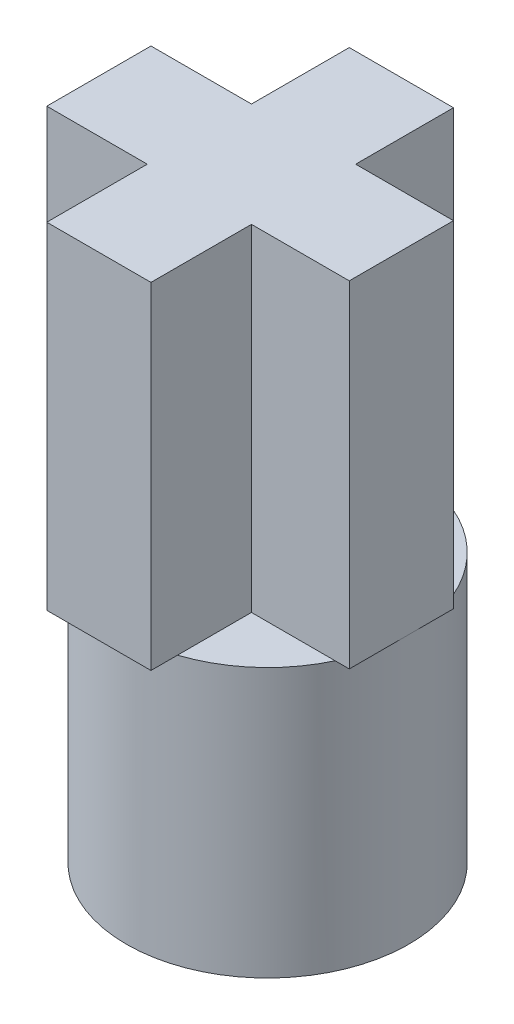
ISO-10303-21;
HEADER;
FILE_DESCRIPTION(('STEP AP214'),'2;1');
FILE_NAME('part.step','',(''),(''),'','','');
FILE_SCHEMA(('AUTOMOTIVE_DESIGN { 1 0 10303 214 1 1 1 1 }'));
ENDSEC;
DATA;
#1=APPLICATION_CONTEXT('core data for automotive mechanical design processes');
#2=APPLICATION_PROTOCOL_DEFINITION('international standard','automotive_design',2000,#1);
#3=PRODUCT_CONTEXT('',#1,'mechanical');
#4=PRODUCT('Part','Part','',(#3));
#5=PRODUCT_RELATED_PRODUCT_CATEGORY('part','',(#4));
#6=PRODUCT_DEFINITION_FORMATION('','',#4);
#7=PRODUCT_DEFINITION_CONTEXT('part definition',#1,'design');
#8=PRODUCT_DEFINITION('design','',#6,#7);
#9=PRODUCT_DEFINITION_SHAPE('','',#8);
#10=(LENGTH_UNIT() NAMED_UNIT(*) SI_UNIT(.MILLI.,.METRE.));
#11=(NAMED_UNIT(*) PLANE_ANGLE_UNIT() SI_UNIT($,.RADIAN.));
#12=(NAMED_UNIT(*) SI_UNIT($,.STERADIAN.) SOLID_ANGLE_UNIT());
#13=UNCERTAINTY_MEASURE_WITH_UNIT(LENGTH_MEASURE(1.E-05),#10,'distance_accuracy_value','');
#14=(GEOMETRIC_REPRESENTATION_CONTEXT(3) GLOBAL_UNCERTAINTY_ASSIGNED_CONTEXT((#13)) GLOBAL_UNIT_ASSIGNED_CONTEXT((#10,
#11,#12)) REPRESENTATION_CONTEXT('',''));
#15=CARTESIAN_POINT('',(0.,0.,0.));
#16=DIRECTION('',(0.,0.,1.));
#17=DIRECTION('',(1.,0.,0.));
#18=AXIS2_PLACEMENT_3D('',#15,#16,#17);
#19=CARTESIAN_POINT('',(0.,4.,0.));
#20=DIRECTION('',(0.,1.,0.));
#21=DIRECTION('',(0.,0.,1.));
#22=AXIS2_PLACEMENT_3D('',#19,#20,#21);
#23=PLANE('',#22);
#24=DIRECTION('',(0.,0.,-1.));
#25=VECTOR('',#24,1.);
#26=CARTESIAN_POINT('',(0.655,4.,-0.655));
#27=LINE('',#26,#25);
#28=CARTESIAN_POINT('',(0.655,4.,-0.655));
#29=VERTEX_POINT('',#28);
#30=CARTESIAN_POINT('',(0.655,4.,-1.99523808103194));
#31=VERTEX_POINT('',#30);
#32=EDGE_CURVE('E53',#29,#31,#27,.T.);
#33=ORIENTED_EDGE('',*,*,#32,.F.);
#34=DIRECTION('',(-1.,0.,0.));
#35=VECTOR('',#34,1.);
#36=CARTESIAN_POINT('',(2.11,4.,-0.655));
#37=LINE('',#36,#35);
#38=CARTESIAN_POINT('',(1.99523808103194,4.,-0.655));
#39=VERTEX_POINT('',#38);
#40=EDGE_CURVE('E11',#39,#29,#37,.T.);
#41=ORIENTED_EDGE('',*,*,#40,.F.);
#42=CARTESIAN_POINT('',(0.,4.,0.));
#43=DIRECTION('',(0.,1.,0.));
#44=DIRECTION('',(0.,0.,1.));
#45=AXIS2_PLACEMENT_3D('',#42,#43,#44);
#46=CIRCLE('',#45,2.1);
#47=EDGE_CURVE('E197',#39,#31,#46,.T.);
#48=ORIENTED_EDGE('',*,*,#47,.T.);
#49=EDGE_LOOP('',(#33,#41,#48));
#50=FACE_BOUND('',#49,.T.);
#51=ADVANCED_FACE('F35',(#50),#23,.T.);
#52=DIRECTION('',(1.,0.,0.));
#53=VECTOR('',#52,1.);
#54=CARTESIAN_POINT('',(2.11,4.,0.895));
#55=LINE('',#54,#53);
#56=CARTESIAN_POINT('',(0.655,4.,0.895));
#57=VERTEX_POINT('',#56);
#58=CARTESIAN_POINT('',(1.89973024400834,4.,0.895));
#59=VERTEX_POINT('',#58);
#60=EDGE_CURVE('E60',#57,#59,#55,.T.);
#61=ORIENTED_EDGE('',*,*,#60,.F.);
#62=DIRECTION('',(0.,0.,-1.));
#63=VECTOR('',#62,1.);
#64=CARTESIAN_POINT('',(0.655,4.,2.39));
#65=LINE('',#64,#63);
#66=CARTESIAN_POINT('',(0.655,4.,1.99523808103194));
#67=VERTEX_POINT('',#66);
#68=EDGE_CURVE('E44',#67,#57,#65,.T.);
#69=ORIENTED_EDGE('',*,*,#68,.F.);
#70=EDGE_CURVE('E188',#67,#59,#46,.T.);
#71=ORIENTED_EDGE('',*,*,#70,.T.);
#72=EDGE_LOOP('',(#61,#69,#71));
#73=FACE_BOUND('',#72,.T.);
#74=ADVANCED_FACE('F227',(#73),#23,.T.);
#75=DIRECTION('',(0.,0.,1.));
#76=VECTOR('',#75,1.);
#77=CARTESIAN_POINT('',(-0.895,4.,2.39));
#78=LINE('',#77,#76);
#79=CARTESIAN_POINT('',(-0.895,4.,0.895));
#80=VERTEX_POINT('',#79);
#81=CARTESIAN_POINT('',(-0.895,4.,1.89973024400834));
#82=VERTEX_POINT('',#81);
#83=EDGE_CURVE('E442',#80,#82,#78,.T.);
#84=ORIENTED_EDGE('',*,*,#83,.F.);
#85=DIRECTION('',(1.,0.,0.));
#86=VECTOR('',#85,1.);
#87=CARTESIAN_POINT('',(-0.895,4.,0.895));
#88=LINE('',#87,#86);
#89=CARTESIAN_POINT('',(-1.89973024400834,4.,0.895));
#90=VERTEX_POINT('',#89);
#91=EDGE_CURVE('E193',#90,#80,#88,.T.);
#92=ORIENTED_EDGE('',*,*,#91,.F.);
#93=EDGE_CURVE('E199',#90,#82,#46,.T.);
#94=ORIENTED_EDGE('',*,*,#93,.T.);
#95=EDGE_LOOP('',(#84,#92,#94));
#96=FACE_BOUND('',#95,.T.);
#97=ADVANCED_FACE('F224',(#96),#23,.T.);
#98=CARTESIAN_POINT('',(0.,4.,0.));
#99=DIRECTION('',(0.,-1.,0.));
#100=DIRECTION('',(0.,0.,-1.));
#101=AXIS2_PLACEMENT_3D('',#98,#99,#100);
#102=CYLINDRICAL_SURFACE('',#101,2.1);
#103=ORIENTED_EDGE('',*,*,#70,.F.);
#104=EDGE_CURVE('E190',#82,#67,#46,.T.);
#105=ORIENTED_EDGE('',*,*,#104,.F.);
#106=ORIENTED_EDGE('',*,*,#93,.F.);
#107=CARTESIAN_POINT('',(-1.99523808103194,4.,-0.655));
#108=VERTEX_POINT('',#107);
#109=EDGE_CURVE('E205',#108,#90,#46,.T.);
#110=ORIENTED_EDGE('',*,*,#109,.F.);
#111=CARTESIAN_POINT('',(-0.895,4.,-1.89973024400834));
#112=VERTEX_POINT('',#111);
#113=EDGE_CURVE('E523',#112,#108,#46,.T.);
#114=ORIENTED_EDGE('',*,*,#113,.F.);
#115=EDGE_CURVE('E524',#31,#112,#46,.T.);
#116=ORIENTED_EDGE('',*,*,#115,.F.);
#117=ORIENTED_EDGE('',*,*,#47,.F.);
#118=EDGE_CURVE('E189',#59,#39,#46,.T.);
#119=ORIENTED_EDGE('',*,*,#118,.F.);
#120=EDGE_LOOP('',(#103,#105,#106,#110,#114,#116,#117,#119));
#121=FACE_BOUND('',#120,.T.);
#122=CARTESIAN_POINT('',(0.,0.,0.));
#123=DIRECTION('',(0.,1.,0.));
#124=DIRECTION('',(0.,0.,1.));
#125=AXIS2_PLACEMENT_3D('',#122,#123,#124);
#126=CIRCLE('',#125,2.1);
#127=CARTESIAN_POINT('',(0.,0.,2.1));
#128=VERTEX_POINT('',#127);
#129=EDGE_CURVE('E39',#128,#128,#126,.T.);
#130=ORIENTED_EDGE('',*,*,#129,.T.);
#131=EDGE_LOOP('',(#130));
#132=FACE_BOUND('',#131,.T.);
#133=ADVANCED_FACE('F37',(#121,#132),#102,.T.);
#134=DIRECTION('',(0.,0.,1.));
#135=VECTOR('',#134,1.);
#136=CARTESIAN_POINT('',(-0.895,4.,-0.655));
#137=LINE('',#136,#135);
#138=CARTESIAN_POINT('',(-0.895,4.,-0.655));
#139=VERTEX_POINT('',#138);
#140=EDGE_CURVE('E177',#112,#139,#137,.T.);
#141=ORIENTED_EDGE('',*,*,#140,.F.);
#142=ORIENTED_EDGE('',*,*,#113,.T.);
#143=DIRECTION('',(-1.,0.,0.));
#144=VECTOR('',#143,1.);
#145=CARTESIAN_POINT('',(-0.895,4.,-0.655));
#146=LINE('',#145,#144);
#147=EDGE_CURVE('E498',#139,#108,#146,.T.);
#148=ORIENTED_EDGE('',*,*,#147,.F.);
#149=EDGE_LOOP('',(#141,#142,#148));
#150=FACE_BOUND('',#149,.T.);
#151=ADVANCED_FACE('F213',(#150),#23,.T.);
#152=CARTESIAN_POINT('',(0.,0.,0.));
#153=DIRECTION('',(0.,1.,0.));
#154=DIRECTION('',(0.,0.,1.));
#155=AXIS2_PLACEMENT_3D('',#152,#153,#154);
#156=PLANE('',#155);
#157=CARTESIAN_POINT('',(0.,0.,0.));
#158=DIRECTION('',(0.,-1.,0.));
#159=DIRECTION('',(0.,0.,-1.));
#160=AXIS2_PLACEMENT_3D('',#157,#158,#159);
#161=CIRCLE('',#160,1.6);
#162=CARTESIAN_POINT('',(0.,0.,-1.6));
#163=VERTEX_POINT('',#162);
#164=EDGE_CURVE('E178',#163,#163,#161,.T.);
#165=ORIENTED_EDGE('',*,*,#164,.F.);
#166=EDGE_LOOP('',(#165));
#167=FACE_BOUND('',#166,.T.);
#168=ORIENTED_EDGE('',*,*,#129,.F.);
#169=EDGE_LOOP('',(#168));
#170=FACE_BOUND('',#169,.T.);
#171=ADVANCED_FACE('F210',(#167,#170),#156,.F.);
#172=CARTESIAN_POINT('',(0.,3.,0.));
#173=DIRECTION('',(0.,-1.,0.));
#174=DIRECTION('',(0.,0.,-1.));
#175=AXIS2_PLACEMENT_3D('',#172,#173,#174);
#176=CYLINDRICAL_SURFACE('',#175,1.6);
#177=CARTESIAN_POINT('',(0.,3.,0.));
#178=DIRECTION('',(0.,-1.,0.));
#179=DIRECTION('',(0.,0.,-1.));
#180=AXIS2_PLACEMENT_3D('',#177,#178,#179);
#181=CIRCLE('',#180,1.6);
#182=CARTESIAN_POINT('',(0.,3.,-1.6));
#183=VERTEX_POINT('',#182);
#184=EDGE_CURVE('E181',#183,#183,#181,.T.);
#185=ORIENTED_EDGE('',*,*,#184,.F.);
#186=EDGE_LOOP('',(#185));
#187=FACE_BOUND('',#186,.T.);
#188=ORIENTED_EDGE('',*,*,#164,.T.);
#189=EDGE_LOOP('',(#188));
#190=FACE_BOUND('',#189,.T.);
#191=ADVANCED_FACE('F212',(#187,#190),#176,.F.);
#192=CARTESIAN_POINT('',(0.,3.,0.));
#193=DIRECTION('',(0.,-1.,0.));
#194=DIRECTION('',(0.,0.,-1.));
#195=AXIS2_PLACEMENT_3D('',#192,#193,#194);
#196=PLANE('',#195);
#197=ORIENTED_EDGE('',*,*,#184,.T.);
#198=EDGE_LOOP('',(#197));
#199=FACE_BOUND('',#198,.T.);
#200=ADVANCED_FACE('F219',(#199),#196,.T.);
#201=CARTESIAN_POINT('',(0.,4.,0.));
#202=DIRECTION('',(0.,1.,0.));
#203=DIRECTION('',(0.,0.,1.));
#204=AXIS2_PLACEMENT_3D('',#201,#202,#203);
#205=PLANE('',#204);
#206=CARTESIAN_POINT('',(2.11,4.,0.895));
#207=VERTEX_POINT('',#206);
#208=EDGE_CURVE('E492',#59,#207,#55,.T.);
#209=ORIENTED_EDGE('',*,*,#208,.F.);
#210=ORIENTED_EDGE('',*,*,#118,.T.);
#211=CARTESIAN_POINT('',(2.11,4.,-0.655));
#212=VERTEX_POINT('',#211);
#213=EDGE_CURVE('E46',#212,#39,#37,.T.);
#214=ORIENTED_EDGE('',*,*,#213,.F.);
#215=DIRECTION('',(0.,0.,-1.));
#216=VECTOR('',#215,1.);
#217=CARTESIAN_POINT('',(2.11,4.,0.895));
#218=LINE('',#217,#216);
#219=EDGE_CURVE('E489',#207,#212,#218,.T.);
#220=ORIENTED_EDGE('',*,*,#219,.F.);
#221=EDGE_LOOP('',(#209,#210,#214,#220));
#222=FACE_BOUND('',#221,.T.);
#223=ADVANCED_FACE('F234',(#222),#205,.F.);
#224=CARTESIAN_POINT('',(0.655,4.,-2.11));
#225=VERTEX_POINT('',#224);
#226=EDGE_CURVE('E486',#31,#225,#27,.T.);
#227=ORIENTED_EDGE('',*,*,#226,.F.);
#228=ORIENTED_EDGE('',*,*,#115,.T.);
#229=CARTESIAN_POINT('',(-0.895,4.,-2.11));
#230=VERTEX_POINT('',#229);
#231=EDGE_CURVE('E195',#230,#112,#137,.T.);
#232=ORIENTED_EDGE('',*,*,#231,.F.);
#233=DIRECTION('',(-1.,0.,0.));
#234=VECTOR('',#233,1.);
#235=CARTESIAN_POINT('',(0.655,4.,-2.11));
#236=LINE('',#235,#234);
#237=EDGE_CURVE('E172',#225,#230,#236,.T.);
#238=ORIENTED_EDGE('',*,*,#237,.F.);
#239=EDGE_LOOP('',(#227,#228,#232,#238));
#240=FACE_BOUND('',#239,.T.);
#241=ADVANCED_FACE('F283',(#240),#205,.F.);
#242=CARTESIAN_POINT('',(-2.39,4.,-0.655));
#243=VERTEX_POINT('',#242);
#244=EDGE_CURVE('E499',#108,#243,#146,.T.);
#245=ORIENTED_EDGE('',*,*,#244,.F.);
#246=ORIENTED_EDGE('',*,*,#109,.T.);
#247=CARTESIAN_POINT('',(-2.39,4.,0.895));
#248=VERTEX_POINT('',#247);
#249=EDGE_CURVE('E456',#248,#90,#88,.T.);
#250=ORIENTED_EDGE('',*,*,#249,.F.);
#251=DIRECTION('',(0.,0.,1.));
#252=VECTOR('',#251,1.);
#253=CARTESIAN_POINT('',(-2.39,4.,0.895));
#254=LINE('',#253,#252);
#255=EDGE_CURVE('E496',#243,#248,#254,.T.);
#256=ORIENTED_EDGE('',*,*,#255,.F.);
#257=EDGE_LOOP('',(#245,#246,#250,#256));
#258=FACE_BOUND('',#257,.T.);
#259=ADVANCED_FACE('F342',(#258),#205,.F.);
#260=CARTESIAN_POINT('',(-0.895,4.,2.39));
#261=VERTEX_POINT('',#260);
#262=EDGE_CURVE('E447',#82,#261,#78,.T.);
#263=ORIENTED_EDGE('',*,*,#262,.F.);
#264=ORIENTED_EDGE('',*,*,#104,.T.);
#265=CARTESIAN_POINT('',(0.655,4.,2.39));
#266=VERTEX_POINT('',#265);
#267=EDGE_CURVE('E493',#266,#67,#65,.T.);
#268=ORIENTED_EDGE('',*,*,#267,.F.);
#269=DIRECTION('',(1.,0.,0.));
#270=VECTOR('',#269,1.);
#271=CARTESIAN_POINT('',(0.655,4.,2.39));
#272=LINE('',#271,#270);
#273=EDGE_CURVE('E446',#261,#266,#272,.T.);
#274=ORIENTED_EDGE('',*,*,#273,.F.);
#275=EDGE_LOOP('',(#263,#264,#268,#274));
#276=FACE_BOUND('',#275,.T.);
#277=ADVANCED_FACE('F238',(#276),#205,.F.);
#278=CARTESIAN_POINT('',(-0.895,9.,-0.655));
#279=DIRECTION('',(1.,0.,0.));
#280=DIRECTION('',(0.,0.,-1.));
#281=AXIS2_PLACEMENT_3D('',#278,#279,#280);
#282=PLANE('',#281);
#283=ORIENTED_EDGE('',*,*,#231,.T.);
#284=ORIENTED_EDGE('',*,*,#140,.T.);
#285=DIRECTION('',(0.,-1.,0.));
#286=VECTOR('',#285,1.);
#287=CARTESIAN_POINT('',(-0.895,9.,-0.655));
#288=LINE('',#287,#286);
#289=CARTESIAN_POINT('',(-0.895,9.,-0.655));
#290=VERTEX_POINT('',#289);
#291=EDGE_CURVE('E157',#290,#139,#288,.T.);
#292=ORIENTED_EDGE('',*,*,#291,.F.);
#293=DIRECTION('',(0.,0.,1.));
#294=VECTOR('',#293,1.);
#295=CARTESIAN_POINT('',(-0.895,9.,-0.655));
#296=LINE('',#295,#294);
#297=CARTESIAN_POINT('',(-0.895,9.,-2.11));
#298=VERTEX_POINT('',#297);
#299=EDGE_CURVE('E163',#298,#290,#296,.T.);
#300=ORIENTED_EDGE('',*,*,#299,.F.);
#301=DIRECTION('',(0.,-1.,0.));
#302=VECTOR('',#301,1.);
#303=CARTESIAN_POINT('',(-0.895,9.,-2.11));
#304=LINE('',#303,#302);
#305=EDGE_CURVE('E483',#298,#230,#304,.T.);
#306=ORIENTED_EDGE('',*,*,#305,.T.);
#307=EDGE_LOOP('',(#283,#284,#292,#300,#306));
#308=FACE_BOUND('',#307,.T.);
#309=ADVANCED_FACE('F176',(#308),#282,.F.);
#310=CARTESIAN_POINT('',(-0.895,9.,-0.655));
#311=DIRECTION('',(0.,0.,1.));
#312=DIRECTION('',(1.,0.,0.));
#313=AXIS2_PLACEMENT_3D('',#310,#311,#312);
#314=PLANE('',#313);
#315=ORIENTED_EDGE('',*,*,#147,.T.);
#316=ORIENTED_EDGE('',*,*,#244,.T.);
#317=DIRECTION('',(0.,-1.,0.));
#318=VECTOR('',#317,1.);
#319=CARTESIAN_POINT('',(-2.39,9.,-0.655));
#320=LINE('',#319,#318);
#321=CARTESIAN_POINT('',(-2.39,9.,-0.655));
#322=VERTEX_POINT('',#321);
#323=EDGE_CURVE('E159',#322,#243,#320,.T.);
#324=ORIENTED_EDGE('',*,*,#323,.F.);
#325=DIRECTION('',(-1.,0.,0.));
#326=VECTOR('',#325,1.);
#327=CARTESIAN_POINT('',(-0.895,9.,-0.655));
#328=LINE('',#327,#326);
#329=EDGE_CURVE('E152',#290,#322,#328,.T.);
#330=ORIENTED_EDGE('',*,*,#329,.F.);
#331=ORIENTED_EDGE('',*,*,#291,.T.);
#332=EDGE_LOOP('',(#315,#316,#324,#330,#331));
#333=FACE_BOUND('',#332,.T.);
#334=ADVANCED_FACE('F155',(#333),#314,.F.);
#335=CARTESIAN_POINT('',(-2.39,9.,0.895));
#336=DIRECTION('',(1.,0.,0.));
#337=DIRECTION('',(0.,0.,-1.));
#338=AXIS2_PLACEMENT_3D('',#335,#336,#337);
#339=PLANE('',#338);
#340=ORIENTED_EDGE('',*,*,#255,.T.);
#341=DIRECTION('',(0.,-1.,0.));
#342=VECTOR('',#341,1.);
#343=CARTESIAN_POINT('',(-2.39,9.,0.895));
#344=LINE('',#343,#342);
#345=CARTESIAN_POINT('',(-2.39,9.,0.895));
#346=VERTEX_POINT('',#345);
#347=EDGE_CURVE('E183',#346,#248,#344,.T.);
#348=ORIENTED_EDGE('',*,*,#347,.F.);
#349=DIRECTION('',(0.,0.,1.));
#350=VECTOR('',#349,1.);
#351=CARTESIAN_POINT('',(-2.39,9.,0.895));
#352=LINE('',#351,#350);
#353=EDGE_CURVE('E162',#322,#346,#352,.T.);
#354=ORIENTED_EDGE('',*,*,#353,.F.);
#355=ORIENTED_EDGE('',*,*,#323,.T.);
#356=EDGE_LOOP('',(#340,#348,#354,#355));
#357=FACE_BOUND('',#356,.T.);
#358=ADVANCED_FACE('F241',(#357),#339,.F.);
#359=CARTESIAN_POINT('',(-0.895,9.,0.895));
#360=DIRECTION('',(0.,0.,-1.));
#361=DIRECTION('',(-1.,0.,0.));
#362=AXIS2_PLACEMENT_3D('',#359,#360,#361);
#363=PLANE('',#362);
#364=ORIENTED_EDGE('',*,*,#249,.T.);
#365=ORIENTED_EDGE('',*,*,#91,.T.);
#366=DIRECTION('',(0.,-1.,0.));
#367=VECTOR('',#366,1.);
#368=CARTESIAN_POINT('',(-0.895,9.,0.895));
#369=LINE('',#368,#367);
#370=CARTESIAN_POINT('',(-0.895,9.,0.895));
#371=VERTEX_POINT('',#370);
#372=EDGE_CURVE('E452',#371,#80,#369,.T.);
#373=ORIENTED_EDGE('',*,*,#372,.F.);
#374=DIRECTION('',(1.,0.,0.));
#375=VECTOR('',#374,1.);
#376=CARTESIAN_POINT('',(-0.895,9.,0.895));
#377=LINE('',#376,#375);
#378=EDGE_CURVE('E515',#346,#371,#377,.T.);
#379=ORIENTED_EDGE('',*,*,#378,.F.);
#380=ORIENTED_EDGE('',*,*,#347,.T.);
#381=EDGE_LOOP('',(#364,#365,#373,#379,#380));
#382=FACE_BOUND('',#381,.T.);
#383=ADVANCED_FACE('F244',(#382),#363,.F.);
#384=CARTESIAN_POINT('',(-0.895,9.,2.39));
#385=DIRECTION('',(1.,0.,0.));
#386=DIRECTION('',(0.,0.,-1.));
#387=AXIS2_PLACEMENT_3D('',#384,#385,#386);
#388=PLANE('',#387);
#389=ORIENTED_EDGE('',*,*,#83,.T.);
#390=ORIENTED_EDGE('',*,*,#262,.T.);
#391=DIRECTION('',(0.,-1.,0.));
#392=VECTOR('',#391,1.);
#393=CARTESIAN_POINT('',(-0.895,9.,2.39));
#394=LINE('',#393,#392);
#395=CARTESIAN_POINT('',(-0.895,9.,2.39));
#396=VERTEX_POINT('',#395);
#397=EDGE_CURVE('E460',#396,#261,#394,.T.);
#398=ORIENTED_EDGE('',*,*,#397,.F.);
#399=DIRECTION('',(0.,0.,1.));
#400=VECTOR('',#399,1.);
#401=CARTESIAN_POINT('',(-0.895,9.,2.39));
#402=LINE('',#401,#400);
#403=EDGE_CURVE('E459',#371,#396,#402,.T.);
#404=ORIENTED_EDGE('',*,*,#403,.F.);
#405=ORIENTED_EDGE('',*,*,#372,.T.);
#406=EDGE_LOOP('',(#389,#390,#398,#404,#405));
#407=FACE_BOUND('',#406,.T.);
#408=ADVANCED_FACE('F248',(#407),#388,.F.);
#409=CARTESIAN_POINT('',(0.655,9.,2.39));
#410=DIRECTION('',(0.,0.,-1.));
#411=DIRECTION('',(-1.,0.,0.));
#412=AXIS2_PLACEMENT_3D('',#409,#410,#411);
#413=PLANE('',#412);
#414=ORIENTED_EDGE('',*,*,#273,.T.);
#415=DIRECTION('',(0.,-1.,0.));
#416=VECTOR('',#415,1.);
#417=CARTESIAN_POINT('',(0.655,9.,2.39));
#418=LINE('',#417,#416);
#419=CARTESIAN_POINT('',(0.655,9.,2.39));
#420=VERTEX_POINT('',#419);
#421=EDGE_CURVE('E463',#420,#266,#418,.T.);
#422=ORIENTED_EDGE('',*,*,#421,.F.);
#423=DIRECTION('',(1.,0.,0.));
#424=VECTOR('',#423,1.);
#425=CARTESIAN_POINT('',(0.655,9.,2.39));
#426=LINE('',#425,#424);
#427=EDGE_CURVE('E512',#396,#420,#426,.T.);
#428=ORIENTED_EDGE('',*,*,#427,.F.);
#429=ORIENTED_EDGE('',*,*,#397,.T.);
#430=EDGE_LOOP('',(#414,#422,#428,#429));
#431=FACE_BOUND('',#430,.T.);
#432=ADVANCED_FACE('F252',(#431),#413,.F.);
#433=CARTESIAN_POINT('',(0.655,9.,2.39));
#434=DIRECTION('',(-1.,0.,0.));
#435=DIRECTION('',(0.,0.,1.));
#436=AXIS2_PLACEMENT_3D('',#433,#434,#435);
#437=PLANE('',#436);
#438=ORIENTED_EDGE('',*,*,#267,.T.);
#439=ORIENTED_EDGE('',*,*,#68,.T.);
#440=DIRECTION('',(0.,-1.,0.));
#441=VECTOR('',#440,1.);
#442=CARTESIAN_POINT('',(0.655,9.,0.895));
#443=LINE('',#442,#441);
#444=CARTESIAN_POINT('',(0.655,9.,0.895));
#445=VERTEX_POINT('',#444);
#446=EDGE_CURVE('E468',#445,#57,#443,.T.);
#447=ORIENTED_EDGE('',*,*,#446,.F.);
#448=DIRECTION('',(0.,0.,-1.));
#449=VECTOR('',#448,1.);
#450=CARTESIAN_POINT('',(0.655,9.,2.39));
#451=LINE('',#450,#449);
#452=EDGE_CURVE('E510',#420,#445,#451,.T.);
#453=ORIENTED_EDGE('',*,*,#452,.F.);
#454=ORIENTED_EDGE('',*,*,#421,.T.);
#455=EDGE_LOOP('',(#438,#439,#447,#453,#454));
#456=FACE_BOUND('',#455,.T.);
#457=ADVANCED_FACE('F256',(#456),#437,.F.);
#458=CARTESIAN_POINT('',(2.11,9.,0.895));
#459=DIRECTION('',(0.,0.,-1.));
#460=DIRECTION('',(-1.,0.,0.));
#461=AXIS2_PLACEMENT_3D('',#458,#459,#460);
#462=PLANE('',#461);
#463=ORIENTED_EDGE('',*,*,#60,.T.);
#464=ORIENTED_EDGE('',*,*,#208,.T.);
#465=DIRECTION('',(0.,-1.,0.));
#466=VECTOR('',#465,1.);
#467=CARTESIAN_POINT('',(2.11,9.,0.895));
#468=LINE('',#467,#466);
#469=CARTESIAN_POINT('',(2.11,9.,0.895));
#470=VERTEX_POINT('',#469);
#471=EDGE_CURVE('E471',#470,#207,#468,.T.);
#472=ORIENTED_EDGE('',*,*,#471,.F.);
#473=DIRECTION('',(1.,0.,0.));
#474=VECTOR('',#473,1.);
#475=CARTESIAN_POINT('',(2.11,9.,0.895));
#476=LINE('',#475,#474);
#477=EDGE_CURVE('E508',#445,#470,#476,.T.);
#478=ORIENTED_EDGE('',*,*,#477,.F.);
#479=ORIENTED_EDGE('',*,*,#446,.T.);
#480=EDGE_LOOP('',(#463,#464,#472,#478,#479));
#481=FACE_BOUND('',#480,.T.);
#482=ADVANCED_FACE('F260',(#481),#462,.F.);
#483=CARTESIAN_POINT('',(2.11,9.,0.895));
#484=DIRECTION('',(-1.,0.,0.));
#485=DIRECTION('',(0.,0.,1.));
#486=AXIS2_PLACEMENT_3D('',#483,#484,#485);
#487=PLANE('',#486);
#488=ORIENTED_EDGE('',*,*,#219,.T.);
#489=DIRECTION('',(0.,-1.,0.));
#490=VECTOR('',#489,1.);
#491=CARTESIAN_POINT('',(2.11,9.,-0.655));
#492=LINE('',#491,#490);
#493=CARTESIAN_POINT('',(2.11,9.,-0.655));
#494=VERTEX_POINT('',#493);
#495=EDGE_CURVE('E474',#494,#212,#492,.T.);
#496=ORIENTED_EDGE('',*,*,#495,.F.);
#497=DIRECTION('',(0.,0.,-1.));
#498=VECTOR('',#497,1.);
#499=CARTESIAN_POINT('',(2.11,9.,0.895));
#500=LINE('',#499,#498);
#501=EDGE_CURVE('E506',#470,#494,#500,.T.);
#502=ORIENTED_EDGE('',*,*,#501,.F.);
#503=ORIENTED_EDGE('',*,*,#471,.T.);
#504=EDGE_LOOP('',(#488,#496,#502,#503));
#505=FACE_BOUND('',#504,.T.);
#506=ADVANCED_FACE('F264',(#505),#487,.F.);
#507=CARTESIAN_POINT('',(2.11,9.,-0.655));
#508=DIRECTION('',(0.,0.,1.));
#509=DIRECTION('',(1.,0.,0.));
#510=AXIS2_PLACEMENT_3D('',#507,#508,#509);
#511=PLANE('',#510);
#512=ORIENTED_EDGE('',*,*,#213,.T.);
#513=ORIENTED_EDGE('',*,*,#40,.T.);
#514=DIRECTION('',(0.,-1.,0.));
#515=VECTOR('',#514,1.);
#516=CARTESIAN_POINT('',(0.655,9.,-0.655));
#517=LINE('',#516,#515);
#518=CARTESIAN_POINT('',(0.655,9.,-0.655));
#519=VERTEX_POINT('',#518);
#520=EDGE_CURVE('E477',#519,#29,#517,.T.);
#521=ORIENTED_EDGE('',*,*,#520,.F.);
#522=DIRECTION('',(-1.,0.,0.));
#523=VECTOR('',#522,1.);
#524=CARTESIAN_POINT('',(2.11,9.,-0.655));
#525=LINE('',#524,#523);
#526=EDGE_CURVE('E504',#494,#519,#525,.T.);
#527=ORIENTED_EDGE('',*,*,#526,.F.);
#528=ORIENTED_EDGE('',*,*,#495,.T.);
#529=EDGE_LOOP('',(#512,#513,#521,#527,#528));
#530=FACE_BOUND('',#529,.T.);
#531=ADVANCED_FACE('F268',(#530),#511,.F.);
#532=CARTESIAN_POINT('',(0.655,9.,-0.655));
#533=DIRECTION('',(-1.,0.,0.));
#534=DIRECTION('',(0.,0.,1.));
#535=AXIS2_PLACEMENT_3D('',#532,#533,#534);
#536=PLANE('',#535);
#537=ORIENTED_EDGE('',*,*,#32,.T.);
#538=ORIENTED_EDGE('',*,*,#226,.T.);
#539=DIRECTION('',(0.,-1.,0.));
#540=VECTOR('',#539,1.);
#541=CARTESIAN_POINT('',(0.655,9.,-2.11));
#542=LINE('',#541,#540);
#543=CARTESIAN_POINT('',(0.655,9.,-2.11));
#544=VERTEX_POINT('',#543);
#545=EDGE_CURVE('E480',#544,#225,#542,.T.);
#546=ORIENTED_EDGE('',*,*,#545,.F.);
#547=DIRECTION('',(0.,0.,-1.));
#548=VECTOR('',#547,1.);
#549=CARTESIAN_POINT('',(0.655,9.,-0.655));
#550=LINE('',#549,#548);
#551=EDGE_CURVE('E502',#519,#544,#550,.T.);
#552=ORIENTED_EDGE('',*,*,#551,.F.);
#553=ORIENTED_EDGE('',*,*,#520,.T.);
#554=EDGE_LOOP('',(#537,#538,#546,#552,#553));
#555=FACE_BOUND('',#554,.T.);
#556=ADVANCED_FACE('F272',(#555),#536,.F.);
#557=CARTESIAN_POINT('',(0.655,9.,-2.11));
#558=DIRECTION('',(0.,0.,1.));
#559=DIRECTION('',(1.,0.,0.));
#560=AXIS2_PLACEMENT_3D('',#557,#558,#559);
#561=PLANE('',#560);
#562=ORIENTED_EDGE('',*,*,#237,.T.);
#563=ORIENTED_EDGE('',*,*,#305,.F.);
#564=DIRECTION('',(-1.,0.,0.));
#565=VECTOR('',#564,1.);
#566=CARTESIAN_POINT('',(0.655,9.,-2.11));
#567=LINE('',#566,#565);
#568=EDGE_CURVE('E168',#544,#298,#567,.T.);
#569=ORIENTED_EDGE('',*,*,#568,.F.);
#570=ORIENTED_EDGE('',*,*,#545,.T.);
#571=EDGE_LOOP('',(#562,#563,#569,#570));
#572=FACE_BOUND('',#571,.T.);
#573=ADVANCED_FACE('F276',(#572),#561,.F.);
#574=CARTESIAN_POINT('',(0.,9.,0.));
#575=DIRECTION('',(0.,1.,0.));
#576=DIRECTION('',(0.,0.,1.));
#577=AXIS2_PLACEMENT_3D('',#574,#575,#576);
#578=PLANE('',#577);
#579=ORIENTED_EDGE('',*,*,#299,.T.);
#580=ORIENTED_EDGE('',*,*,#329,.T.);
#581=ORIENTED_EDGE('',*,*,#353,.T.);
#582=ORIENTED_EDGE('',*,*,#378,.T.);
#583=ORIENTED_EDGE('',*,*,#403,.T.);
#584=ORIENTED_EDGE('',*,*,#427,.T.);
#585=ORIENTED_EDGE('',*,*,#452,.T.);
#586=ORIENTED_EDGE('',*,*,#477,.T.);
#587=ORIENTED_EDGE('',*,*,#501,.T.);
#588=ORIENTED_EDGE('',*,*,#526,.T.);
#589=ORIENTED_EDGE('',*,*,#551,.T.);
#590=ORIENTED_EDGE('',*,*,#568,.T.);
#591=EDGE_LOOP('',(#579,#580,#581,#582,#583,#584,#585,#586,#587,#588,#589,#590));
#592=FACE_BOUND('',#591,.T.);
#593=ADVANCED_FACE('F166',(#592),#578,.T.);
#594=CLOSED_SHELL('',(#51,#74,#97,#133,#151,#171,#191,#200,#223,#241,#259,#277,#309,#334,#358,
#383,#408,#432,#457,#482,#506,#531,#556,#573,#593));
#595=MANIFOLD_SOLID_BREP('B2',#594);
#596=ADVANCED_BREP_SHAPE_REPRESENTATION('',(#18,#595),#14);
#597=SHAPE_DEFINITION_REPRESENTATION(#9,#596);
ENDSEC;
END-ISO-10303-21;
